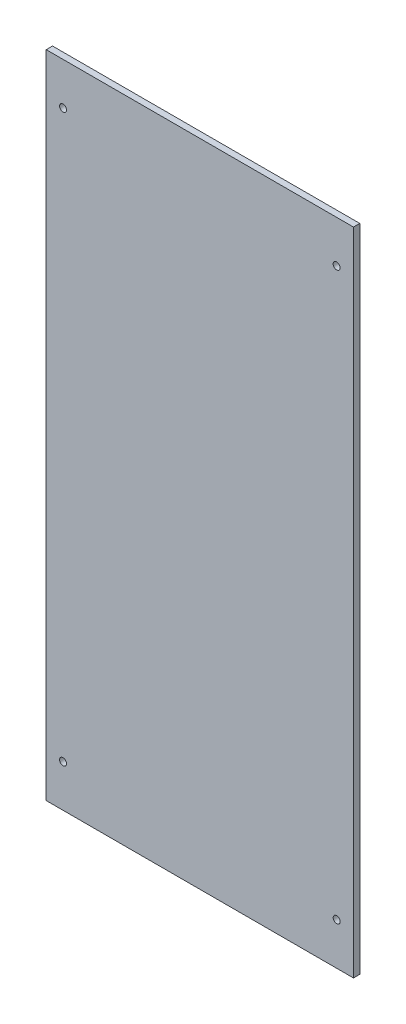
ISO-10303-21;
HEADER;
FILE_DESCRIPTION(('STEP AP214'),'2;1');
FILE_NAME('part.step','',(''),(''),'','','');
FILE_SCHEMA(('AUTOMOTIVE_DESIGN { 1 0 10303 214 1 1 1 1 }'));
ENDSEC;
DATA;
#1=APPLICATION_CONTEXT('core data for automotive mechanical design processes');
#2=APPLICATION_PROTOCOL_DEFINITION('international standard','automotive_design',2000,#1);
#3=PRODUCT_CONTEXT('',#1,'mechanical');
#4=PRODUCT('Part','Part','',(#3));
#5=PRODUCT_RELATED_PRODUCT_CATEGORY('part','',(#4));
#6=PRODUCT_DEFINITION_FORMATION('','',#4);
#7=PRODUCT_DEFINITION_CONTEXT('part definition',#1,'design');
#8=PRODUCT_DEFINITION('design','',#6,#7);
#9=PRODUCT_DEFINITION_SHAPE('','',#8);
#10=(LENGTH_UNIT() NAMED_UNIT(*) SI_UNIT(.MILLI.,.METRE.));
#11=(NAMED_UNIT(*) PLANE_ANGLE_UNIT() SI_UNIT($,.RADIAN.));
#12=(NAMED_UNIT(*) SI_UNIT($,.STERADIAN.) SOLID_ANGLE_UNIT());
#13=UNCERTAINTY_MEASURE_WITH_UNIT(LENGTH_MEASURE(1.E-05),#10,'distance_accuracy_value','');
#14=(GEOMETRIC_REPRESENTATION_CONTEXT(3) GLOBAL_UNCERTAINTY_ASSIGNED_CONTEXT((#13)) GLOBAL_UNIT_ASSIGNED_CONTEXT((#10,
#11,#12)) REPRESENTATION_CONTEXT('',''));
#15=CARTESIAN_POINT('',(0.,0.,0.));
#16=DIRECTION('',(0.,0.,1.));
#17=DIRECTION('',(1.,0.,0.));
#18=AXIS2_PLACEMENT_3D('',#15,#16,#17);
#19=CARTESIAN_POINT('',(0.,0.,3.));
#20=DIRECTION('',(1.,0.,0.));
#21=DIRECTION('',(0.,0.,-1.));
#22=AXIS2_PLACEMENT_3D('',#19,#20,#21);
#23=PLANE('',#22);
#24=DIRECTION('',(0.,-1.,0.));
#25=VECTOR('',#24,1.);
#26=CARTESIAN_POINT('',(0.,0.,0.));
#27=LINE('',#26,#25);
#28=CARTESIAN_POINT('',(0.,309.,0.));
#29=VERTEX_POINT('',#28);
#30=CARTESIAN_POINT('',(0.,0.,0.));
#31=VERTEX_POINT('',#30);
#32=EDGE_CURVE('E118',#29,#31,#27,.T.);
#33=ORIENTED_EDGE('',*,*,#32,.T.);
#34=DIRECTION('',(0.,0.,-1.));
#35=VECTOR('',#34,1.);
#36=CARTESIAN_POINT('',(0.,0.,3.));
#37=LINE('',#36,#35);
#38=CARTESIAN_POINT('',(0.,0.,3.));
#39=VERTEX_POINT('',#38);
#40=EDGE_CURVE('E12',#39,#31,#37,.T.);
#41=ORIENTED_EDGE('',*,*,#40,.F.);
#42=DIRECTION('',(0.,-1.,0.));
#43=VECTOR('',#42,1.);
#44=CARTESIAN_POINT('',(0.,0.,3.));
#45=LINE('',#44,#43);
#46=CARTESIAN_POINT('',(0.,309.,3.));
#47=VERTEX_POINT('',#46);
#48=EDGE_CURVE('E90',#47,#39,#45,.T.);
#49=ORIENTED_EDGE('',*,*,#48,.F.);
#50=DIRECTION('',(0.,0.,-1.));
#51=VECTOR('',#50,1.);
#52=CARTESIAN_POINT('',(0.,309.,3.));
#53=LINE('',#52,#51);
#54=EDGE_CURVE('E98',#47,#29,#53,.T.);
#55=ORIENTED_EDGE('',*,*,#54,.T.);
#56=EDGE_LOOP('',(#33,#41,#49,#55));
#57=FACE_BOUND('',#56,.T.);
#58=ADVANCED_FACE('F39',(#57),#23,.F.);
#59=CARTESIAN_POINT('',(0.,0.,3.));
#60=DIRECTION('',(0.,1.,0.));
#61=DIRECTION('',(0.,0.,1.));
#62=AXIS2_PLACEMENT_3D('',#59,#60,#61);
#63=PLANE('',#62);
#64=DIRECTION('',(1.,0.,0.));
#65=VECTOR('',#64,1.);
#66=CARTESIAN_POINT('',(0.,0.,0.));
#67=LINE('',#66,#65);
#68=CARTESIAN_POINT('',(146.,0.,0.));
#69=VERTEX_POINT('',#68);
#70=EDGE_CURVE('E94',#31,#69,#67,.T.);
#71=ORIENTED_EDGE('',*,*,#70,.T.);
#72=DIRECTION('',(0.,0.,-1.));
#73=VECTOR('',#72,1.);
#74=CARTESIAN_POINT('',(146.,0.,3.));
#75=LINE('',#74,#73);
#76=CARTESIAN_POINT('',(146.,0.,3.));
#77=VERTEX_POINT('',#76);
#78=EDGE_CURVE('E47',#77,#69,#75,.T.);
#79=ORIENTED_EDGE('',*,*,#78,.F.);
#80=DIRECTION('',(1.,0.,0.));
#81=VECTOR('',#80,1.);
#82=CARTESIAN_POINT('',(0.,0.,3.));
#83=LINE('',#82,#81);
#84=EDGE_CURVE('E85',#39,#77,#83,.T.);
#85=ORIENTED_EDGE('',*,*,#84,.F.);
#86=ORIENTED_EDGE('',*,*,#40,.T.);
#87=EDGE_LOOP('',(#71,#79,#85,#86));
#88=FACE_BOUND('',#87,.T.);
#89=ADVANCED_FACE('F93',(#88),#63,.F.);
#90=CARTESIAN_POINT('',(146.,0.,3.));
#91=DIRECTION('',(-1.,0.,0.));
#92=DIRECTION('',(0.,0.,1.));
#93=AXIS2_PLACEMENT_3D('',#90,#91,#92);
#94=PLANE('',#93);
#95=DIRECTION('',(0.,1.,0.));
#96=VECTOR('',#95,1.);
#97=CARTESIAN_POINT('',(146.,0.,0.));
#98=LINE('',#97,#96);
#99=CARTESIAN_POINT('',(146.,309.,0.));
#100=VERTEX_POINT('',#99);
#101=EDGE_CURVE('E72',#69,#100,#98,.T.);
#102=ORIENTED_EDGE('',*,*,#101,.T.);
#103=DIRECTION('',(0.,0.,-1.));
#104=VECTOR('',#103,1.);
#105=CARTESIAN_POINT('',(146.,309.,3.));
#106=LINE('',#105,#104);
#107=CARTESIAN_POINT('',(146.,309.,3.));
#108=VERTEX_POINT('',#107);
#109=EDGE_CURVE('E95',#108,#100,#106,.T.);
#110=ORIENTED_EDGE('',*,*,#109,.F.);
#111=DIRECTION('',(0.,1.,0.));
#112=VECTOR('',#111,1.);
#113=CARTESIAN_POINT('',(146.,0.,3.));
#114=LINE('',#113,#112);
#115=EDGE_CURVE('E88',#77,#108,#114,.T.);
#116=ORIENTED_EDGE('',*,*,#115,.F.);
#117=ORIENTED_EDGE('',*,*,#78,.T.);
#118=EDGE_LOOP('',(#102,#110,#116,#117));
#119=FACE_BOUND('',#118,.T.);
#120=ADVANCED_FACE('F96',(#119),#94,.F.);
#121=CARTESIAN_POINT('',(0.,309.,3.));
#122=DIRECTION('',(0.,-1.,0.));
#123=DIRECTION('',(0.,0.,-1.));
#124=AXIS2_PLACEMENT_3D('',#121,#122,#123);
#125=PLANE('',#124);
#126=DIRECTION('',(-1.,0.,0.));
#127=VECTOR('',#126,1.);
#128=CARTESIAN_POINT('',(0.,309.,0.));
#129=LINE('',#128,#127);
#130=EDGE_CURVE('E78',#100,#29,#129,.T.);
#131=ORIENTED_EDGE('',*,*,#130,.T.);
#132=ORIENTED_EDGE('',*,*,#54,.F.);
#133=DIRECTION('',(-1.,0.,0.));
#134=VECTOR('',#133,1.);
#135=CARTESIAN_POINT('',(0.,309.,3.));
#136=LINE('',#135,#134);
#137=EDGE_CURVE('E55',#108,#47,#136,.T.);
#138=ORIENTED_EDGE('',*,*,#137,.F.);
#139=ORIENTED_EDGE('',*,*,#109,.T.);
#140=EDGE_LOOP('',(#131,#132,#138,#139));
#141=FACE_BOUND('',#140,.T.);
#142=ADVANCED_FACE('F154',(#141),#125,.F.);
#143=CARTESIAN_POINT('',(0.,0.,3.));
#144=DIRECTION('',(0.,0.,-1.));
#145=DIRECTION('',(-1.,0.,0.));
#146=AXIS2_PLACEMENT_3D('',#143,#144,#145);
#147=PLANE('',#146);
#148=CARTESIAN_POINT('',(7.99999999999998,20.,3.));
#149=DIRECTION('',(0.,0.,1.));
#150=DIRECTION('',(-1.,0.,0.));
#151=AXIS2_PLACEMENT_3D('',#148,#149,#150);
#152=CIRCLE('',#151,1.65);
#153=CARTESIAN_POINT('',(6.34999999999998,20.,3.));
#154=VERTEX_POINT('',#153);
#155=EDGE_CURVE('E119',#154,#154,#152,.T.);
#156=ORIENTED_EDGE('',*,*,#155,.F.);
#157=EDGE_LOOP('',(#156));
#158=FACE_BOUND('',#157,.T.);
#159=CARTESIAN_POINT('',(138.,20.,3.));
#160=DIRECTION('',(0.,0.,1.));
#161=DIRECTION('',(1.,0.,0.));
#162=AXIS2_PLACEMENT_3D('',#159,#160,#161);
#163=CIRCLE('',#162,1.64999999999999);
#164=CARTESIAN_POINT('',(139.65,20.,3.));
#165=VERTEX_POINT('',#164);
#166=EDGE_CURVE('E128',#165,#165,#163,.T.);
#167=ORIENTED_EDGE('',*,*,#166,.F.);
#168=EDGE_LOOP('',(#167));
#169=FACE_BOUND('',#168,.T.);
#170=CARTESIAN_POINT('',(138.,289.,3.));
#171=DIRECTION('',(0.,0.,1.));
#172=DIRECTION('',(-1.,0.,0.));
#173=AXIS2_PLACEMENT_3D('',#170,#171,#172);
#174=CIRCLE('',#173,1.65000000000002);
#175=CARTESIAN_POINT('',(136.35,289.,3.));
#176=VERTEX_POINT('',#175);
#177=EDGE_CURVE('E134',#176,#176,#174,.T.);
#178=ORIENTED_EDGE('',*,*,#177,.F.);
#179=EDGE_LOOP('',(#178));
#180=FACE_BOUND('',#179,.T.);
#181=CARTESIAN_POINT('',(7.99999999999998,289.,3.));
#182=DIRECTION('',(0.,0.,1.));
#183=DIRECTION('',(1.,0.,0.));
#184=AXIS2_PLACEMENT_3D('',#181,#182,#183);
#185=CIRCLE('',#184,1.65000000000002);
#186=CARTESIAN_POINT('',(9.65,289.,3.));
#187=VERTEX_POINT('',#186);
#188=EDGE_CURVE('E110',#187,#187,#185,.T.);
#189=ORIENTED_EDGE('',*,*,#188,.F.);
#190=EDGE_LOOP('',(#189));
#191=FACE_BOUND('',#190,.T.);
#192=ORIENTED_EDGE('',*,*,#48,.T.);
#193=ORIENTED_EDGE('',*,*,#84,.T.);
#194=ORIENTED_EDGE('',*,*,#115,.T.);
#195=ORIENTED_EDGE('',*,*,#137,.T.);
#196=EDGE_LOOP('',(#192,#193,#194,#195));
#197=FACE_BOUND('',#196,.T.);
#198=ADVANCED_FACE('F86',(#158,#169,#180,#191,#197),#147,.F.);
#199=CARTESIAN_POINT('',(0.,0.,0.));
#200=DIRECTION('',(0.,0.,-1.));
#201=DIRECTION('',(-1.,0.,0.));
#202=AXIS2_PLACEMENT_3D('',#199,#200,#201);
#203=PLANE('',#202);
#204=CARTESIAN_POINT('',(7.99999999999998,20.,0.));
#205=DIRECTION('',(0.,0.,1.));
#206=DIRECTION('',(-1.,0.,0.));
#207=AXIS2_PLACEMENT_3D('',#204,#205,#206);
#208=CIRCLE('',#207,1.65);
#209=CARTESIAN_POINT('',(6.34999999999998,20.,0.));
#210=VERTEX_POINT('',#209);
#211=EDGE_CURVE('E123',#210,#210,#208,.T.);
#212=ORIENTED_EDGE('',*,*,#211,.T.);
#213=EDGE_LOOP('',(#212));
#214=FACE_BOUND('',#213,.T.);
#215=CARTESIAN_POINT('',(138.,20.,0.));
#216=DIRECTION('',(0.,0.,1.));
#217=DIRECTION('',(1.,0.,0.));
#218=AXIS2_PLACEMENT_3D('',#215,#216,#217);
#219=CIRCLE('',#218,1.64999999999999);
#220=CARTESIAN_POINT('',(139.65,20.,0.));
#221=VERTEX_POINT('',#220);
#222=EDGE_CURVE('E132',#221,#221,#219,.T.);
#223=ORIENTED_EDGE('',*,*,#222,.T.);
#224=EDGE_LOOP('',(#223));
#225=FACE_BOUND('',#224,.T.);
#226=CARTESIAN_POINT('',(138.,289.,0.));
#227=DIRECTION('',(0.,0.,1.));
#228=DIRECTION('',(-1.,0.,0.));
#229=AXIS2_PLACEMENT_3D('',#226,#227,#228);
#230=CIRCLE('',#229,1.65000000000002);
#231=CARTESIAN_POINT('',(136.35,289.,0.));
#232=VERTEX_POINT('',#231);
#233=EDGE_CURVE('E115',#232,#232,#230,.T.);
#234=ORIENTED_EDGE('',*,*,#233,.T.);
#235=EDGE_LOOP('',(#234));
#236=FACE_BOUND('',#235,.T.);
#237=CARTESIAN_POINT('',(7.99999999999998,289.,0.));
#238=DIRECTION('',(0.,0.,1.));
#239=DIRECTION('',(1.,0.,0.));
#240=AXIS2_PLACEMENT_3D('',#237,#238,#239);
#241=CIRCLE('',#240,1.65000000000002);
#242=CARTESIAN_POINT('',(9.65,289.,0.));
#243=VERTEX_POINT('',#242);
#244=EDGE_CURVE('E114',#243,#243,#241,.T.);
#245=ORIENTED_EDGE('',*,*,#244,.T.);
#246=EDGE_LOOP('',(#245));
#247=FACE_BOUND('',#246,.T.);
#248=ORIENTED_EDGE('',*,*,#32,.F.);
#249=ORIENTED_EDGE('',*,*,#130,.F.);
#250=ORIENTED_EDGE('',*,*,#101,.F.);
#251=ORIENTED_EDGE('',*,*,#70,.F.);
#252=EDGE_LOOP('',(#248,#249,#250,#251));
#253=FACE_BOUND('',#252,.T.);
#254=ADVANCED_FACE('F141',(#214,#225,#236,#247,#253),#203,.T.);
#255=CARTESIAN_POINT('',(7.99999999999998,289.,0.));
#256=DIRECTION('',(0.,0.,1.));
#257=DIRECTION('',(1.,0.,0.));
#258=AXIS2_PLACEMENT_3D('',#255,#256,#257);
#259=CYLINDRICAL_SURFACE('',#258,1.65000000000002);
#260=ORIENTED_EDGE('',*,*,#244,.F.);
#261=EDGE_LOOP('',(#260));
#262=FACE_BOUND('',#261,.T.);
#263=ORIENTED_EDGE('',*,*,#188,.T.);
#264=EDGE_LOOP('',(#263));
#265=FACE_BOUND('',#264,.T.);
#266=ADVANCED_FACE('F148',(#262,#265),#259,.F.);
#267=CARTESIAN_POINT('',(138.,289.,0.));
#268=DIRECTION('',(0.,0.,1.));
#269=DIRECTION('',(1.,0.,0.));
#270=AXIS2_PLACEMENT_3D('',#267,#268,#269);
#271=CYLINDRICAL_SURFACE('',#270,1.65000000000002);
#272=ORIENTED_EDGE('',*,*,#233,.F.);
#273=EDGE_LOOP('',(#272));
#274=FACE_BOUND('',#273,.T.);
#275=ORIENTED_EDGE('',*,*,#177,.T.);
#276=EDGE_LOOP('',(#275));
#277=FACE_BOUND('',#276,.T.);
#278=ADVANCED_FACE('F144',(#274,#277),#271,.F.);
#279=CARTESIAN_POINT('',(138.,20.,0.));
#280=DIRECTION('',(0.,0.,1.));
#281=DIRECTION('',(1.,0.,0.));
#282=AXIS2_PLACEMENT_3D('',#279,#280,#281);
#283=CYLINDRICAL_SURFACE('',#282,1.64999999999999);
#284=ORIENTED_EDGE('',*,*,#222,.F.);
#285=EDGE_LOOP('',(#284));
#286=FACE_BOUND('',#285,.T.);
#287=ORIENTED_EDGE('',*,*,#166,.T.);
#288=EDGE_LOOP('',(#287));
#289=FACE_BOUND('',#288,.T.);
#290=ADVANCED_FACE('F147',(#286,#289),#283,.F.);
#291=CARTESIAN_POINT('',(7.99999999999998,20.,0.));
#292=DIRECTION('',(0.,0.,1.));
#293=DIRECTION('',(1.,0.,0.));
#294=AXIS2_PLACEMENT_3D('',#291,#292,#293);
#295=CYLINDRICAL_SURFACE('',#294,1.65);
#296=ORIENTED_EDGE('',*,*,#211,.F.);
#297=EDGE_LOOP('',(#296));
#298=FACE_BOUND('',#297,.T.);
#299=ORIENTED_EDGE('',*,*,#155,.T.);
#300=EDGE_LOOP('',(#299));
#301=FACE_BOUND('',#300,.T.);
#302=ADVANCED_FACE('F233',(#298,#301),#295,.F.);
#303=CLOSED_SHELL('',(#58,#89,#120,#142,#198,#254,#266,#278,#290,#302));
#304=MANIFOLD_SOLID_BREP('B2',#303);
#305=ADVANCED_BREP_SHAPE_REPRESENTATION('',(#18,#304),#14);
#306=SHAPE_DEFINITION_REPRESENTATION(#9,#305);
ENDSEC;
END-ISO-10303-21;
